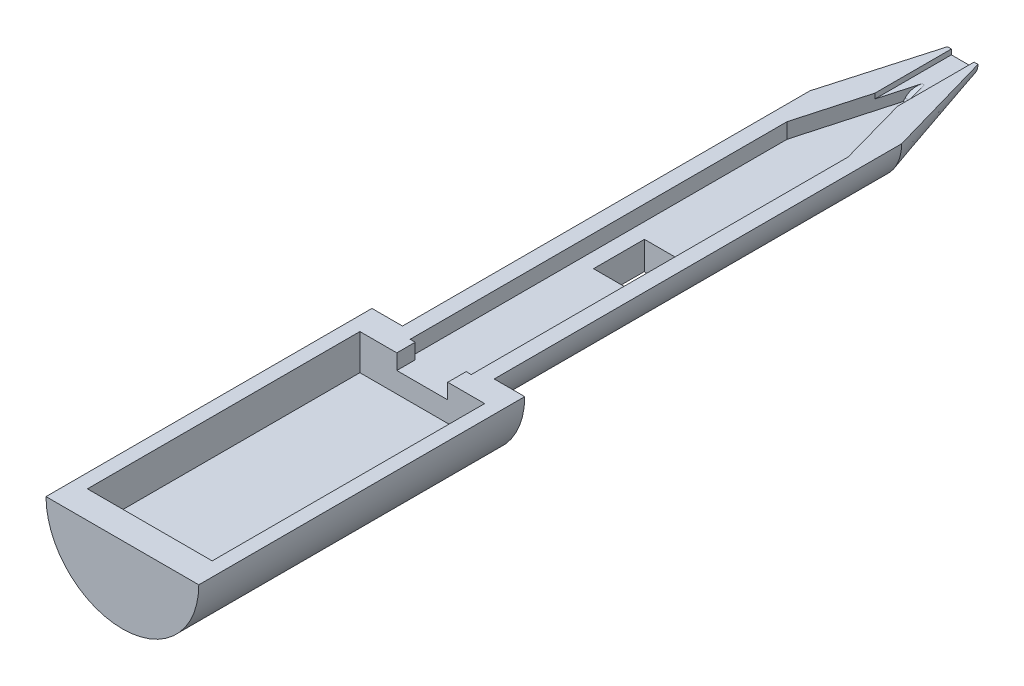
ISO-10303-21;
HEADER;
FILE_DESCRIPTION(('STEP AP214'),'2;1');
FILE_NAME('part.step','',(''),(''),'','','');
FILE_SCHEMA(('AUTOMOTIVE_DESIGN { 1 0 10303 214 1 1 1 1 }'));
ENDSEC;
DATA;
#1=APPLICATION_CONTEXT('core data for automotive mechanical design processes');
#2=APPLICATION_PROTOCOL_DEFINITION('international standard','automotive_design',2000,#1);
#3=PRODUCT_CONTEXT('',#1,'mechanical');
#4=PRODUCT('Part','Part','',(#3));
#5=PRODUCT_RELATED_PRODUCT_CATEGORY('part','',(#4));
#6=PRODUCT_DEFINITION_FORMATION('','',#4);
#7=PRODUCT_DEFINITION_CONTEXT('part definition',#1,'design');
#8=PRODUCT_DEFINITION('design','',#6,#7);
#9=PRODUCT_DEFINITION_SHAPE('','',#8);
#10=(LENGTH_UNIT() NAMED_UNIT(*) SI_UNIT(.MILLI.,.METRE.));
#11=(NAMED_UNIT(*) PLANE_ANGLE_UNIT() SI_UNIT($,.RADIAN.));
#12=(NAMED_UNIT(*) SI_UNIT($,.STERADIAN.) SOLID_ANGLE_UNIT());
#13=UNCERTAINTY_MEASURE_WITH_UNIT(LENGTH_MEASURE(1.E-05),#10,'distance_accuracy_value','');
#14=(GEOMETRIC_REPRESENTATION_CONTEXT(3) GLOBAL_UNCERTAINTY_ASSIGNED_CONTEXT((#13)) GLOBAL_UNIT_ASSIGNED_CONTEXT((#10,
#11,#12)) REPRESENTATION_CONTEXT('',''));
#15=CARTESIAN_POINT('',(0.,0.,0.));
#16=DIRECTION('',(0.,0.,1.));
#17=DIRECTION('',(1.,0.,0.));
#18=AXIS2_PLACEMENT_3D('',#15,#16,#17);
#19=CARTESIAN_POINT('',(12.2500000000001,-6.99999999999991,-58.8824675416096));
#20=DIRECTION('',(0.,0.,-1.));
#21=DIRECTION('',(0.,1.,0.));
#22=AXIS2_PLACEMENT_3D('',#19,#20,#21);
#23=PLANE('',#22);
#24=DIRECTION('',(0.,1.,0.));
#25=VECTOR('',#24,1.);
#26=CARTESIAN_POINT('',(5.00000000000005,-7.39733340645304,-58.8824675416096));
#27=LINE('',#26,#25);
#28=CARTESIAN_POINT('',(5.00000000000005,-2.99999999999997,-58.8824675416096));
#29=VERTEX_POINT('',#28);
#30=CARTESIAN_POINT('',(5.,0.,-58.8824675416096));
#31=VERTEX_POINT('',#30);
#32=EDGE_CURVE('E336',#29,#31,#27,.T.);
#33=ORIENTED_EDGE('',*,*,#32,.F.);
#34=DIRECTION('',(-1.,0.,0.));
#35=VECTOR('',#34,1.);
#36=CARTESIAN_POINT('',(-4.99999999999998,-3.00000000000003,-58.8824675416096));
#37=LINE('',#36,#35);
#38=CARTESIAN_POINT('',(-4.99999999999998,-3.00000000000003,-58.8824675416096));
#39=VERTEX_POINT('',#38);
#40=EDGE_CURVE('E317',#29,#39,#37,.T.);
#41=ORIENTED_EDGE('',*,*,#40,.T.);
#42=DIRECTION('',(0.,1.,0.));
#43=VECTOR('',#42,1.);
#44=CARTESIAN_POINT('',(-4.99999999999995,-7.3973334064531,-58.8824675416096));
#45=LINE('',#44,#43);
#46=CARTESIAN_POINT('',(-5.,0.,-58.8824675416096));
#47=VERTEX_POINT('',#46);
#48=EDGE_CURVE('E322',#39,#47,#45,.T.);
#49=ORIENTED_EDGE('',*,*,#48,.T.);
#50=DIRECTION('',(-1.,0.,0.));
#51=VECTOR('',#50,1.);
#52=CARTESIAN_POINT('',(12.25,0.,-58.8824675416096));
#53=LINE('',#52,#51);
#54=CARTESIAN_POINT('',(-12.25,0.,-58.8824675416096));
#55=VERTEX_POINT('',#54);
#56=EDGE_CURVE('E429',#47,#55,#53,.T.);
#57=ORIENTED_EDGE('',*,*,#56,.T.);
#58=DIRECTION('',(0.,1.,0.));
#59=VECTOR('',#58,1.);
#60=CARTESIAN_POINT('',(-12.25,-7.00000000000009,-58.8824675416096));
#61=LINE('',#60,#59);
#62=CARTESIAN_POINT('',(-12.25,-7.00000000000009,-58.8824675416096));
#63=VERTEX_POINT('',#62);
#64=EDGE_CURVE('E433',#63,#55,#61,.T.);
#65=ORIENTED_EDGE('',*,*,#64,.F.);
#66=DIRECTION('',(-1.,0.,0.));
#67=VECTOR('',#66,1.);
#68=CARTESIAN_POINT('',(12.2500000000001,-6.99999999999991,-58.8824675416096));
#69=LINE('',#68,#67);
#70=CARTESIAN_POINT('',(12.2500000000001,-6.99999999999991,-58.8824675416096));
#71=VERTEX_POINT('',#70);
#72=EDGE_CURVE('E414',#71,#63,#69,.T.);
#73=ORIENTED_EDGE('',*,*,#72,.F.);
#74=DIRECTION('',(0.,1.,0.));
#75=VECTOR('',#74,1.);
#76=CARTESIAN_POINT('',(12.2500000000001,-6.99999999999991,-58.8824675416096));
#77=LINE('',#76,#75);
#78=CARTESIAN_POINT('',(12.25,0.,-58.8824675416096));
#79=VERTEX_POINT('',#78);
#80=EDGE_CURVE('E438',#71,#79,#77,.T.);
#81=ORIENTED_EDGE('',*,*,#80,.T.);
#82=EDGE_CURVE('E406',#79,#31,#53,.T.);
#83=ORIENTED_EDGE('',*,*,#82,.T.);
#84=EDGE_LOOP('',(#33,#41,#49,#57,#65,#73,#81,#83));
#85=FACE_BOUND('',#84,.T.);
#86=ADVANCED_FACE('F44',(#85),#23,.F.);
#87=CARTESIAN_POINT('',(-5.99999999999998,-3.00000000000004,-62.5));
#88=DIRECTION('',(0.,0.,1.));
#89=DIRECTION('',(1.,0.,0.));
#90=AXIS2_PLACEMENT_3D('',#87,#88,#89);
#91=PLANE('',#90);
#92=DIRECTION('',(1.,0.,0.));
#93=VECTOR('',#92,1.);
#94=CARTESIAN_POINT('',(-5.99999999999998,-3.00000000000004,-62.5));
#95=LINE('',#94,#93);
#96=CARTESIAN_POINT('',(5.00000000000002,-2.99999999999997,-62.5));
#97=VERTEX_POINT('',#96);
#98=CARTESIAN_POINT('',(6.00000000000002,-2.99999999999996,-62.5));
#99=VERTEX_POINT('',#98);
#100=EDGE_CURVE('E352',#97,#99,#95,.T.);
#101=ORIENTED_EDGE('',*,*,#100,.F.);
#102=DIRECTION('',(0.,1.,0.));
#103=VECTOR('',#102,1.);
#104=CARTESIAN_POINT('',(5.00000000000005,-7.39733340645304,-62.5));
#105=LINE('',#104,#103);
#106=CARTESIAN_POINT('',(5.,0.,-62.5));
#107=VERTEX_POINT('',#106);
#108=EDGE_CURVE('E339',#97,#107,#105,.T.);
#109=ORIENTED_EDGE('',*,*,#108,.T.);
#110=DIRECTION('',(1.,0.,0.));
#111=VECTOR('',#110,1.);
#112=CARTESIAN_POINT('',(-6.,0.,-62.5));
#113=LINE('',#112,#111);
#114=CARTESIAN_POINT('',(6.,0.,-62.5));
#115=VERTEX_POINT('',#114);
#116=EDGE_CURVE('E373',#107,#115,#113,.T.);
#117=ORIENTED_EDGE('',*,*,#116,.T.);
#118=DIRECTION('',(0.,1.,0.));
#119=VECTOR('',#118,1.);
#120=CARTESIAN_POINT('',(6.00000000000002,-2.99999999999996,-62.5));
#121=LINE('',#120,#119);
#122=EDGE_CURVE('E394',#99,#115,#121,.T.);
#123=ORIENTED_EDGE('',*,*,#122,.F.);
#124=EDGE_LOOP('',(#101,#109,#117,#123));
#125=FACE_BOUND('',#124,.T.);
#126=ADVANCED_FACE('F554',(#125),#91,.F.);
#127=CARTESIAN_POINT('',(0.,0.,0.));
#128=DIRECTION('',(0.,0.,1.));
#129=DIRECTION('',(1.,0.,0.));
#130=AXIS2_PLACEMENT_3D('',#127,#128,#129);
#131=PLANE('',#130);
#132=CARTESIAN_POINT('',(0.,0.,0.));
#133=DIRECTION('',(0.,0.,-1.));
#134=DIRECTION('',(-1.,0.,0.));
#135=AXIS2_PLACEMENT_3D('',#132,#133,#134);
#136=CIRCLE('',#135,15.);
#137=CARTESIAN_POINT('',(15.,1.04744440165294E-13,0.));
#138=VERTEX_POINT('',#137);
#139=CARTESIAN_POINT('',(-15.,0.,0.));
#140=VERTEX_POINT('',#139);
#141=EDGE_CURVE('E240',#138,#140,#136,.T.);
#142=ORIENTED_EDGE('',*,*,#141,.F.);
#143=DIRECTION('',(-1.,0.,0.));
#144=VECTOR('',#143,1.);
#145=CARTESIAN_POINT('',(0.,0.,0.));
#146=LINE('',#145,#144);
#147=EDGE_CURVE('E483',#138,#140,#146,.T.);
#148=ORIENTED_EDGE('',*,*,#147,.T.);
#149=EDGE_LOOP('',(#142,#148));
#150=FACE_BOUND('',#149,.T.);
#151=ADVANCED_FACE('F560',(#150),#131,.T.);
#152=CARTESIAN_POINT('',(0.,0.,-165.));
#153=DIRECTION('',(0.,0.,-1.));
#154=DIRECTION('',(-1.,0.,0.));
#155=AXIS2_PLACEMENT_3D('',#152,#153,#154);
#156=CYLINDRICAL_SURFACE('',#155,15.);
#157=CARTESIAN_POINT('',(0.,0.,-64.));
#158=DIRECTION('',(0.,0.,-1.));
#159=DIRECTION('',(-1.,0.,0.));
#160=AXIS2_PLACEMENT_3D('',#157,#158,#159);
#161=CIRCLE('',#160,15.);
#162=CARTESIAN_POINT('',(15.,1.04744440165294E-13,-64.));
#163=VERTEX_POINT('',#162);
#164=CARTESIAN_POINT('',(-15.,0.,-64.));
#165=VERTEX_POINT('',#164);
#166=EDGE_CURVE('E496',#163,#165,#161,.T.);
#167=ORIENTED_EDGE('',*,*,#166,.F.);
#168=DIRECTION('',(0.,0.,1.));
#169=VECTOR('',#168,1.);
#170=CARTESIAN_POINT('',(15.,1.04744440165294E-13,0.));
#171=LINE('',#170,#169);
#172=EDGE_CURVE('E479',#163,#138,#171,.T.);
#173=ORIENTED_EDGE('',*,*,#172,.T.);
#174=ORIENTED_EDGE('',*,*,#141,.T.);
#175=DIRECTION('',(0.,0.,1.));
#176=VECTOR('',#175,1.);
#177=CARTESIAN_POINT('',(-15.,0.,0.));
#178=LINE('',#177,#176);
#179=EDGE_CURVE('E458',#165,#140,#178,.T.);
#180=ORIENTED_EDGE('',*,*,#179,.F.);
#181=EDGE_LOOP('',(#167,#173,#174,#180));
#182=FACE_BOUND('',#181,.T.);
#183=ADVANCED_FACE('F596',(#182),#156,.T.);
#184=CARTESIAN_POINT('',(15.,1.04744440165294E-13,-64.));
#185=DIRECTION('',(0.,0.,-1.));
#186=DIRECTION('',(-1.,0.,0.));
#187=AXIS2_PLACEMENT_3D('',#184,#185,#186);
#188=PLANE('',#187);
#189=CARTESIAN_POINT('',(0.,0.,-64.));
#190=DIRECTION('',(0.,0.,-1.));
#191=DIRECTION('',(-1.,0.,0.));
#192=AXIS2_PLACEMENT_3D('',#189,#190,#191);
#193=CIRCLE('',#192,8.99999999999999);
#194=CARTESIAN_POINT('',(8.99999999999999,0.,-64.));
#195=VERTEX_POINT('',#194);
#196=CARTESIAN_POINT('',(-8.99999999999999,0.,-64.));
#197=VERTEX_POINT('',#196);
#198=EDGE_CURVE('E493',#195,#197,#193,.T.);
#199=ORIENTED_EDGE('',*,*,#198,.F.);
#200=DIRECTION('',(1.,0.,0.));
#201=VECTOR('',#200,1.);
#202=CARTESIAN_POINT('',(15.,1.04744440165294E-13,-64.));
#203=LINE('',#202,#201);
#204=EDGE_CURVE('E475',#195,#163,#203,.T.);
#205=ORIENTED_EDGE('',*,*,#204,.T.);
#206=ORIENTED_EDGE('',*,*,#166,.T.);
#207=DIRECTION('',(-1.,0.,0.));
#208=VECTOR('',#207,1.);
#209=CARTESIAN_POINT('',(-15.,0.,-64.));
#210=LINE('',#209,#208);
#211=EDGE_CURVE('E454',#197,#165,#210,.T.);
#212=ORIENTED_EDGE('',*,*,#211,.F.);
#213=EDGE_LOOP('',(#199,#205,#206,#212));
#214=FACE_BOUND('',#213,.T.);
#215=ADVANCED_FACE('F592',(#214),#188,.T.);
#216=CARTESIAN_POINT('',(0.,0.,-165.));
#217=DIRECTION('',(0.,0.,-1.));
#218=DIRECTION('',(-1.,0.,0.));
#219=AXIS2_PLACEMENT_3D('',#216,#217,#218);
#220=CYLINDRICAL_SURFACE('',#219,8.99999999999999);
#221=DIRECTION('',(0.,0.,-1.));
#222=VECTOR('',#221,1.);
#223=CARTESIAN_POINT('',(-2.99999999999993,-8.48528137423858,-165.));
#224=LINE('',#223,#222);
#225=CARTESIAN_POINT('',(-2.99999999999993,-8.48528137423858,-105.5));
#226=VERTEX_POINT('',#225);
#227=CARTESIAN_POINT('',(-2.99999999999994,-8.48528137423858,-95.5));
#228=VERTEX_POINT('',#227);
#229=EDGE_CURVE('E276',#226,#228,#224,.F.);
#230=ORIENTED_EDGE('',*,*,#229,.T.);
#231=CARTESIAN_POINT('',(0.,0.,-95.5));
#232=DIRECTION('',(0.,0.,1.));
#233=DIRECTION('',(1.,0.,0.));
#234=AXIS2_PLACEMENT_3D('',#231,#232,#233);
#235=CIRCLE('',#234,8.99999999999999);
#236=CARTESIAN_POINT('',(3.00000000000006,-8.48528137423854,-95.5));
#237=VERTEX_POINT('',#236);
#238=EDGE_CURVE('E303',#228,#237,#235,.T.);
#239=ORIENTED_EDGE('',*,*,#238,.T.);
#240=DIRECTION('',(0.,0.,-1.));
#241=VECTOR('',#240,1.);
#242=CARTESIAN_POINT('',(3.00000000000005,-8.48528137423854,-165.));
#243=LINE('',#242,#241);
#244=CARTESIAN_POINT('',(3.00000000000005,-8.48528137423854,-105.5));
#245=VERTEX_POINT('',#244);
#246=EDGE_CURVE('E298',#237,#245,#243,.T.);
#247=ORIENTED_EDGE('',*,*,#246,.T.);
#248=CARTESIAN_POINT('',(0.,0.,-105.5));
#249=DIRECTION('',(0.,0.,-1.));
#250=DIRECTION('',(0.,1.,0.));
#251=AXIS2_PLACEMENT_3D('',#248,#249,#250);
#252=CIRCLE('',#251,8.99999999999999);
#253=EDGE_CURVE('E292',#245,#226,#252,.T.);
#254=ORIENTED_EDGE('',*,*,#253,.T.);
#255=EDGE_LOOP('',(#230,#239,#247,#254));
#256=FACE_BOUND('',#255,.T.);
#257=CARTESIAN_POINT('',(0.,0.,-144.));
#258=DIRECTION('',(0.,0.,-1.));
#259=DIRECTION('',(-1.,0.,0.));
#260=AXIS2_PLACEMENT_3D('',#257,#258,#259);
#261=CIRCLE('',#260,8.99999999999999);
#262=CARTESIAN_POINT('',(8.99999999999999,0.,-144.));
#263=VERTEX_POINT('',#262);
#264=CARTESIAN_POINT('',(-8.99999999999999,0.,-144.));
#265=VERTEX_POINT('',#264);
#266=EDGE_CURVE('E490',#263,#265,#261,.T.);
#267=ORIENTED_EDGE('',*,*,#266,.F.);
#268=DIRECTION('',(0.,0.,1.));
#269=VECTOR('',#268,1.);
#270=CARTESIAN_POINT('',(8.99999999999999,0.,-64.));
#271=LINE('',#270,#269);
#272=EDGE_CURVE('E471',#263,#195,#271,.T.);
#273=ORIENTED_EDGE('',*,*,#272,.T.);
#274=ORIENTED_EDGE('',*,*,#198,.T.);
#275=DIRECTION('',(0.,0.,1.));
#276=VECTOR('',#275,1.);
#277=CARTESIAN_POINT('',(-8.99999999999999,0.,-64.));
#278=LINE('',#277,#276);
#279=EDGE_CURVE('E450',#265,#197,#278,.T.);
#280=ORIENTED_EDGE('',*,*,#279,.F.);
#281=EDGE_LOOP('',(#267,#273,#274,#280));
#282=FACE_BOUND('',#281,.T.);
#283=ADVANCED_FACE('F588',(#256,#282),#220,.T.);
#284=CARTESIAN_POINT('',(0.,0.,-165.));
#285=DIRECTION('',(0.,0.,1.));
#286=DIRECTION('',(1.,0.,0.));
#287=AXIS2_PLACEMENT_3D('',#284,#285,#286);
#288=CONICAL_SURFACE('',#287,3.,0.278299659005111);
#289=CARTESIAN_POINT('',(0.,0.,-165.));
#290=DIRECTION('',(0.,0.,-1.));
#291=DIRECTION('',(-1.,0.,0.));
#292=AXIS2_PLACEMENT_3D('',#289,#290,#291);
#293=CIRCLE('',#292,3.);
#294=CARTESIAN_POINT('',(3.,0.,-165.));
#295=VERTEX_POINT('',#294);
#296=CARTESIAN_POINT('',(-3.,0.,-165.));
#297=VERTEX_POINT('',#296);
#298=EDGE_CURVE('E486',#295,#297,#293,.T.);
#299=ORIENTED_EDGE('',*,*,#298,.F.);
#300=DIRECTION('',(0.274721127897378,0.,0.961523947640823));
#301=VECTOR('',#300,1.);
#302=CARTESIAN_POINT('',(8.99999999999999,0.,-144.));
#303=LINE('',#302,#301);
#304=EDGE_CURVE('E467',#295,#263,#303,.T.);
#305=ORIENTED_EDGE('',*,*,#304,.T.);
#306=ORIENTED_EDGE('',*,*,#266,.T.);
#307=DIRECTION('',(-0.274721127897378,0.,0.961523947640823));
#308=VECTOR('',#307,1.);
#309=CARTESIAN_POINT('',(-8.99999999999999,0.,-144.));
#310=LINE('',#309,#308);
#311=EDGE_CURVE('E437',#297,#265,#310,.T.);
#312=ORIENTED_EDGE('',*,*,#311,.F.);
#313=EDGE_LOOP('',(#299,#305,#306,#312));
#314=FACE_BOUND('',#313,.T.);
#315=ADVANCED_FACE('F585',(#314),#288,.T.);
#316=CARTESIAN_POINT('',(3.,0.,-165.));
#317=DIRECTION('',(0.,0.,-1.));
#318=DIRECTION('',(-1.,0.,0.));
#319=AXIS2_PLACEMENT_3D('',#316,#317,#318);
#320=PLANE('',#319);
#321=DIRECTION('',(0.,1.,0.));
#322=VECTOR('',#321,1.);
#323=CARTESIAN_POINT('',(-2.22794117647058,-1.00000000000002,-165.));
#324=LINE('',#323,#322);
#325=CARTESIAN_POINT('',(-2.22794117647058,-1.00000000000002,-165.));
#326=VERTEX_POINT('',#325);
#327=CARTESIAN_POINT('',(-2.22794117647059,0.,-165.));
#328=VERTEX_POINT('',#327);
#329=EDGE_CURVE('E261',#326,#328,#324,.T.);
#330=ORIENTED_EDGE('',*,*,#329,.F.);
#331=DIRECTION('',(-1.,0.,0.));
#332=VECTOR('',#331,1.);
#333=CARTESIAN_POINT('',(-2.22794117647058,-1.00000000000002,-165.));
#334=LINE('',#333,#332);
#335=CARTESIAN_POINT('',(2.2279411764706,-0.999999999999984,-165.));
#336=VERTEX_POINT('',#335);
#337=EDGE_CURVE('E249',#336,#326,#334,.T.);
#338=ORIENTED_EDGE('',*,*,#337,.F.);
#339=DIRECTION('',(0.,1.,0.));
#340=VECTOR('',#339,1.);
#341=CARTESIAN_POINT('',(2.2279411764706,-0.999999999999984,-165.));
#342=LINE('',#341,#340);
#343=CARTESIAN_POINT('',(2.22794117647059,0.,-165.));
#344=VERTEX_POINT('',#343);
#345=EDGE_CURVE('E247',#336,#344,#342,.T.);
#346=ORIENTED_EDGE('',*,*,#345,.T.);
#347=DIRECTION('',(1.,0.,0.));
#348=VECTOR('',#347,1.);
#349=CARTESIAN_POINT('',(3.,0.,-165.));
#350=LINE('',#349,#348);
#351=EDGE_CURVE('E462',#344,#295,#350,.T.);
#352=ORIENTED_EDGE('',*,*,#351,.T.);
#353=ORIENTED_EDGE('',*,*,#298,.T.);
#354=EDGE_CURVE('E463',#297,#328,#350,.T.);
#355=ORIENTED_EDGE('',*,*,#354,.T.);
#356=EDGE_LOOP('',(#330,#338,#346,#352,#353,#355));
#357=FACE_BOUND('',#356,.T.);
#358=ADVANCED_FACE('F536',(#357),#320,.T.);
#359=CARTESIAN_POINT('',(0.,0.,0.));
#360=DIRECTION('',(0.,1.,0.));
#361=DIRECTION('',(0.,0.,-1.));
#362=AXIS2_PLACEMENT_3D('',#359,#360,#361);
#363=PLANE('',#362);
#364=DIRECTION('',(0.,0.,1.));
#365=VECTOR('',#364,1.);
#366=CARTESIAN_POINT('',(-2.22794117647059,0.,-150.));
#367=LINE('',#366,#365);
#368=CARTESIAN_POINT('',(-2.22794117647059,0.,-150.));
#369=VERTEX_POINT('',#368);
#370=EDGE_CURVE('E250',#328,#369,#367,.T.);
#371=ORIENTED_EDGE('',*,*,#370,.F.);
#372=ORIENTED_EDGE('',*,*,#354,.F.);
#373=ORIENTED_EDGE('',*,*,#311,.T.);
#374=ORIENTED_EDGE('',*,*,#279,.T.);
#375=ORIENTED_EDGE('',*,*,#211,.T.);
#376=ORIENTED_EDGE('',*,*,#179,.T.);
#377=ORIENTED_EDGE('',*,*,#147,.F.);
#378=ORIENTED_EDGE('',*,*,#172,.F.);
#379=ORIENTED_EDGE('',*,*,#204,.F.);
#380=ORIENTED_EDGE('',*,*,#272,.F.);
#381=ORIENTED_EDGE('',*,*,#304,.F.);
#382=ORIENTED_EDGE('',*,*,#351,.F.);
#383=DIRECTION('',(0.,0.,-1.));
#384=VECTOR('',#383,1.);
#385=CARTESIAN_POINT('',(2.22794117647059,0.,-165.));
#386=LINE('',#385,#384);
#387=CARTESIAN_POINT('',(2.22794117647059,0.,-150.));
#388=VERTEX_POINT('',#387);
#389=EDGE_CURVE('E530',#388,#344,#386,.T.);
#390=ORIENTED_EDGE('',*,*,#389,.F.);
#391=DIRECTION('',(-0.26910453685374,0.,-0.963110974002858));
#392=VECTOR('',#391,1.);
#393=CARTESIAN_POINT('',(6.00000000000001,0.,-136.5));
#394=LINE('',#393,#392);
#395=CARTESIAN_POINT('',(6.00000000000001,0.,-136.5));
#396=VERTEX_POINT('',#395);
#397=EDGE_CURVE('E255',#396,#388,#394,.T.);
#398=ORIENTED_EDGE('',*,*,#397,.F.);
#399=DIRECTION('',(0.,0.,-1.));
#400=VECTOR('',#399,1.);
#401=CARTESIAN_POINT('',(6.,0.,-62.5));
#402=LINE('',#401,#400);
#403=EDGE_CURVE('E378',#115,#396,#402,.T.);
#404=ORIENTED_EDGE('',*,*,#403,.F.);
#405=ORIENTED_EDGE('',*,*,#116,.F.);
#406=DIRECTION('',(0.,0.,-1.));
#407=VECTOR('',#406,1.);
#408=CARTESIAN_POINT('',(5.,0.,-58.8824675416096));
#409=LINE('',#408,#407);
#410=EDGE_CURVE('E327',#31,#107,#409,.T.);
#411=ORIENTED_EDGE('',*,*,#410,.F.);
#412=ORIENTED_EDGE('',*,*,#82,.F.);
#413=DIRECTION('',(0.,0.,-1.));
#414=VECTOR('',#413,1.);
#415=CARTESIAN_POINT('',(12.25,0.,-5.38246754160956));
#416=LINE('',#415,#414);
#417=CARTESIAN_POINT('',(12.25,0.,-5.38246754160956));
#418=VERTEX_POINT('',#417);
#419=EDGE_CURVE('E425',#418,#79,#416,.T.);
#420=ORIENTED_EDGE('',*,*,#419,.F.);
#421=DIRECTION('',(1.,0.,0.));
#422=VECTOR('',#421,1.);
#423=CARTESIAN_POINT('',(-12.25,0.,-5.38246754160956));
#424=LINE('',#423,#422);
#425=CARTESIAN_POINT('',(-12.25,0.,-5.38246754160956));
#426=VERTEX_POINT('',#425);
#427=EDGE_CURVE('E421',#426,#418,#424,.T.);
#428=ORIENTED_EDGE('',*,*,#427,.F.);
#429=DIRECTION('',(0.,0.,1.));
#430=VECTOR('',#429,1.);
#431=CARTESIAN_POINT('',(-12.25,0.,-58.8824675416096));
#432=LINE('',#431,#430);
#433=EDGE_CURVE('E390',#55,#426,#432,.T.);
#434=ORIENTED_EDGE('',*,*,#433,.F.);
#435=ORIENTED_EDGE('',*,*,#56,.F.);
#436=DIRECTION('',(0.,0.,1.));
#437=VECTOR('',#436,1.);
#438=CARTESIAN_POINT('',(-5.,0.,-62.5));
#439=LINE('',#438,#437);
#440=CARTESIAN_POINT('',(-5.,0.,-62.5));
#441=VERTEX_POINT('',#440);
#442=EDGE_CURVE('E323',#441,#47,#439,.T.);
#443=ORIENTED_EDGE('',*,*,#442,.F.);
#444=CARTESIAN_POINT('',(-6.,0.,-62.5));
#445=VERTEX_POINT('',#444);
#446=EDGE_CURVE('E374',#445,#441,#113,.T.);
#447=ORIENTED_EDGE('',*,*,#446,.F.);
#448=DIRECTION('',(0.,0.,1.));
#449=VECTOR('',#448,1.);
#450=CARTESIAN_POINT('',(-6.00000000000001,0.,-136.5));
#451=LINE('',#450,#449);
#452=CARTESIAN_POINT('',(-6.00000000000001,0.,-136.5));
#453=VERTEX_POINT('',#452);
#454=EDGE_CURVE('E335',#453,#445,#451,.T.);
#455=ORIENTED_EDGE('',*,*,#454,.F.);
#456=DIRECTION('',(-0.26910453685374,0.,0.963110974002858));
#457=VECTOR('',#456,1.);
#458=CARTESIAN_POINT('',(-1.25,0.,-153.5));
#459=LINE('',#458,#457);
#460=EDGE_CURVE('E353',#369,#453,#459,.T.);
#461=ORIENTED_EDGE('',*,*,#460,.F.);
#462=EDGE_LOOP('',(#371,#372,#373,#374,#375,#376,#377,#378,#379,#380,#381,#382,#390,#398,#404,
#405,#411,#412,#420,#428,#434,#435,#443,#447,#455,#461));
#463=FACE_BOUND('',#462,.T.);
#464=ADVANCED_FACE('F540',(#463),#363,.T.);
#465=CARTESIAN_POINT('',(-12.25,-7.00000000000009,-58.8824675416096));
#466=DIRECTION('',(-1.,0.,0.));
#467=DIRECTION('',(0.,-1.,0.));
#468=AXIS2_PLACEMENT_3D('',#465,#466,#467);
#469=PLANE('',#468);
#470=ORIENTED_EDGE('',*,*,#433,.T.);
#471=DIRECTION('',(0.,1.,0.));
#472=VECTOR('',#471,1.);
#473=CARTESIAN_POINT('',(-12.25,-7.00000000000009,-5.38246754160956));
#474=LINE('',#473,#472);
#475=CARTESIAN_POINT('',(-12.25,-7.00000000000009,-5.38246754160956));
#476=VERTEX_POINT('',#475);
#477=EDGE_CURVE('E418',#476,#426,#474,.T.);
#478=ORIENTED_EDGE('',*,*,#477,.F.);
#479=DIRECTION('',(0.,0.,1.));
#480=VECTOR('',#479,1.);
#481=CARTESIAN_POINT('',(-12.25,-7.00000000000009,-58.8824675416096));
#482=LINE('',#481,#480);
#483=EDGE_CURVE('E401',#63,#476,#482,.T.);
#484=ORIENTED_EDGE('',*,*,#483,.F.);
#485=ORIENTED_EDGE('',*,*,#64,.T.);
#486=EDGE_LOOP('',(#470,#478,#484,#485));
#487=FACE_BOUND('',#486,.T.);
#488=ADVANCED_FACE('F573',(#487),#469,.F.);
#489=CARTESIAN_POINT('',(12.25,-6.99999999999991,-5.38246754160956));
#490=DIRECTION('',(1.,0.,0.));
#491=DIRECTION('',(0.,1.,0.));
#492=AXIS2_PLACEMENT_3D('',#489,#490,#491);
#493=PLANE('',#492);
#494=ORIENTED_EDGE('',*,*,#419,.T.);
#495=ORIENTED_EDGE('',*,*,#80,.F.);
#496=DIRECTION('',(0.,0.,-1.));
#497=VECTOR('',#496,1.);
#498=CARTESIAN_POINT('',(12.25,-6.99999999999991,-5.38246754160956));
#499=LINE('',#498,#497);
#500=CARTESIAN_POINT('',(12.25,-6.99999999999991,-5.38246754160956));
#501=VERTEX_POINT('',#500);
#502=EDGE_CURVE('E410',#501,#71,#499,.T.);
#503=ORIENTED_EDGE('',*,*,#502,.F.);
#504=DIRECTION('',(0.,1.,0.));
#505=VECTOR('',#504,1.);
#506=CARTESIAN_POINT('',(12.25,-6.99999999999991,-5.38246754160956));
#507=LINE('',#506,#505);
#508=EDGE_CURVE('E441',#501,#418,#507,.T.);
#509=ORIENTED_EDGE('',*,*,#508,.T.);
#510=EDGE_LOOP('',(#494,#495,#503,#509));
#511=FACE_BOUND('',#510,.T.);
#512=ADVANCED_FACE('F569',(#511),#493,.F.);
#513=CARTESIAN_POINT('',(-12.25,-7.00000000000009,-5.38246754160956));
#514=DIRECTION('',(0.,0.,1.));
#515=DIRECTION('',(0.,-1.,0.));
#516=AXIS2_PLACEMENT_3D('',#513,#514,#515);
#517=PLANE('',#516);
#518=ORIENTED_EDGE('',*,*,#427,.T.);
#519=ORIENTED_EDGE('',*,*,#508,.F.);
#520=DIRECTION('',(1.,0.,0.));
#521=VECTOR('',#520,1.);
#522=CARTESIAN_POINT('',(-12.25,-7.00000000000009,-5.38246754160956));
#523=LINE('',#522,#521);
#524=EDGE_CURVE('E405',#476,#501,#523,.T.);
#525=ORIENTED_EDGE('',*,*,#524,.F.);
#526=ORIENTED_EDGE('',*,*,#477,.T.);
#527=EDGE_LOOP('',(#518,#519,#525,#526));
#528=FACE_BOUND('',#527,.T.);
#529=ADVANCED_FACE('F572',(#528),#517,.F.);
#530=CARTESIAN_POINT('',(0.,-7.,0.));
#531=DIRECTION('',(0.,1.,0.));
#532=DIRECTION('',(-1.,0.,0.));
#533=AXIS2_PLACEMENT_3D('',#530,#531,#532);
#534=PLANE('',#533);
#535=ORIENTED_EDGE('',*,*,#483,.T.);
#536=ORIENTED_EDGE('',*,*,#524,.T.);
#537=ORIENTED_EDGE('',*,*,#502,.T.);
#538=ORIENTED_EDGE('',*,*,#72,.T.);
#539=EDGE_LOOP('',(#535,#536,#537,#538));
#540=FACE_BOUND('',#539,.T.);
#541=ADVANCED_FACE('F567',(#540),#534,.T.);
#542=CARTESIAN_POINT('',(-5.99999999999999,-3.00000000000004,-136.5));
#543=DIRECTION('',(-1.,0.,0.));
#544=DIRECTION('',(0.,-1.,0.));
#545=AXIS2_PLACEMENT_3D('',#542,#543,#544);
#546=PLANE('',#545);
#547=ORIENTED_EDGE('',*,*,#454,.T.);
#548=DIRECTION('',(0.,1.,0.));
#549=VECTOR('',#548,1.);
#550=CARTESIAN_POINT('',(-5.99999999999998,-3.00000000000004,-62.5));
#551=LINE('',#550,#549);
#552=CARTESIAN_POINT('',(-5.99999999999998,-3.00000000000004,-62.5));
#553=VERTEX_POINT('',#552);
#554=EDGE_CURVE('E370',#553,#445,#551,.T.);
#555=ORIENTED_EDGE('',*,*,#554,.F.);
#556=DIRECTION('',(0.,0.,1.));
#557=VECTOR('',#556,1.);
#558=CARTESIAN_POINT('',(-5.99999999999999,-3.00000000000004,-136.5));
#559=LINE('',#558,#557);
#560=CARTESIAN_POINT('',(-5.99999999999999,-3.00000000000004,-136.5));
#561=VERTEX_POINT('',#560);
#562=EDGE_CURVE('E348',#561,#553,#559,.T.);
#563=ORIENTED_EDGE('',*,*,#562,.F.);
#564=DIRECTION('',(0.,1.,0.));
#565=VECTOR('',#564,1.);
#566=CARTESIAN_POINT('',(-5.99999999999999,-3.00000000000004,-136.5));
#567=LINE('',#566,#565);
#568=EDGE_CURVE('E386',#561,#453,#567,.T.);
#569=ORIENTED_EDGE('',*,*,#568,.T.);
#570=EDGE_LOOP('',(#547,#555,#563,#569));
#571=FACE_BOUND('',#570,.T.);
#572=ADVANCED_FACE('F645',(#571),#546,.F.);
#573=CARTESIAN_POINT('',(-1.24999999999998,-3.00000000000001,-153.5));
#574=DIRECTION('',(-0.963110974002858,0.,-0.26910453685374));
#575=DIRECTION('',(-0.26910453685374,0.,0.963110974002858));
#576=AXIS2_PLACEMENT_3D('',#573,#574,#575);
#577=PLANE('',#576);
#578=DIRECTION('',(-0.26910453685374,0.,0.963110974002858));
#579=VECTOR('',#578,1.);
#580=CARTESIAN_POINT('',(-1.24999999999999,-1.00000000000001,-153.5));
#581=LINE('',#580,#579);
#582=CARTESIAN_POINT('',(-0.207221097885146,-1.,-157.232050807569));
#583=VERTEX_POINT('',#582);
#584=CARTESIAN_POINT('',(-2.22794117647058,-1.00000000000002,-150.));
#585=VERTEX_POINT('',#584);
#586=EDGE_CURVE('E267',#583,#585,#581,.T.);
#587=ORIENTED_EDGE('',*,*,#586,.T.);
#588=DIRECTION('',(0.,1.,0.));
#589=VECTOR('',#588,1.);
#590=CARTESIAN_POINT('',(-2.22794117647058,-1.00000000000002,-150.));
#591=LINE('',#590,#589);
#592=EDGE_CURVE('E272',#585,#369,#591,.T.);
#593=ORIENTED_EDGE('',*,*,#592,.T.);
#594=ORIENTED_EDGE('',*,*,#460,.T.);
#595=ORIENTED_EDGE('',*,*,#568,.F.);
#596=DIRECTION('',(-0.26910453685374,0.,0.963110974002858));
#597=VECTOR('',#596,1.);
#598=CARTESIAN_POINT('',(-1.24999999999998,-3.00000000000001,-153.5));
#599=LINE('',#598,#597);
#600=CARTESIAN_POINT('',(-1.01381338572358,-3.00000000000001,-154.345299461621));
#601=VERTEX_POINT('',#600);
#602=EDGE_CURVE('E366',#601,#561,#599,.T.);
#603=ORIENTED_EDGE('',*,*,#602,.F.);
#604=DIRECTION('',(-0.138362149538377,-0.857695713339727,0.495190850979475));
#605=VECTOR('',#604,1.);
#606=CARTESIAN_POINT('',(-1.07625122165548,-3.38704706747956,-154.121837733022));
#607=LINE('',#606,#605);
#608=CARTESIAN_POINT('',(-0.933154156939743,-2.50000000000002,-154.633974596216));
#609=VERTEX_POINT('',#608);
#610=EDGE_CURVE('E505',#601,#609,#607,.F.);
#611=ORIENTED_EDGE('',*,*,#610,.T.);
#612=CARTESIAN_POINT('',(-0.207221097885125,-4.,-157.232050807569));
#613=DIRECTION('',(-0.963110974002858,0.,-0.26910453685374));
#614=DIRECTION('',(0.26910453685374,0.,-0.963110974002858));
#615=AXIS2_PLACEMENT_3D('',#612,#613,#614);
#616=ELLIPSE('',#615,3.11490584260656,3.);
#617=EDGE_CURVE('E11',#609,#583,#616,.T.);
#618=ORIENTED_EDGE('',*,*,#617,.T.);
#619=EDGE_LOOP('',(#587,#593,#594,#595,#603,#611,#618));
#620=FACE_BOUND('',#619,.T.);
#621=ADVANCED_FACE('F545',(#620),#577,.F.);
#622=CARTESIAN_POINT('',(6.00000000000003,-2.99999999999996,-136.5));
#623=DIRECTION('',(0.963110974002858,0.,-0.26910453685374));
#624=DIRECTION('',(-0.26910453685374,0.,-0.963110974002858));
#625=AXIS2_PLACEMENT_3D('',#622,#623,#624);
#626=PLANE('',#625);
#627=ORIENTED_EDGE('',*,*,#397,.T.);
#628=DIRECTION('',(0.,1.,0.));
#629=VECTOR('',#628,1.);
#630=CARTESIAN_POINT('',(2.2279411764706,-0.999999999999984,-150.));
#631=LINE('',#630,#629);
#632=CARTESIAN_POINT('',(2.2279411764706,-0.999999999999984,-150.));
#633=VERTEX_POINT('',#632);
#634=EDGE_CURVE('E244',#633,#388,#631,.T.);
#635=ORIENTED_EDGE('',*,*,#634,.F.);
#636=DIRECTION('',(-0.26910453685374,0.,-0.963110974002858));
#637=VECTOR('',#636,1.);
#638=CARTESIAN_POINT('',(6.00000000000002,-0.999999999999958,-136.5));
#639=LINE('',#638,#637);
#640=CARTESIAN_POINT('',(0.207221097885161,-0.999999999999999,-157.232050807569));
#641=VERTEX_POINT('',#640);
#642=EDGE_CURVE('E230',#633,#641,#639,.T.);
#643=ORIENTED_EDGE('',*,*,#642,.T.);
#644=CARTESIAN_POINT('',(0.207221097885181,-4.,-157.232050807569));
#645=DIRECTION('',(0.963110974002858,0.,-0.26910453685374));
#646=DIRECTION('',(0.26910453685374,0.,0.963110974002858));
#647=AXIS2_PLACEMENT_3D('',#644,#645,#646);
#648=ELLIPSE('',#647,3.11490584260656,3.);
#649=CARTESIAN_POINT('',(0.933154156939779,-2.50000000000001,-154.633974596216));
#650=VERTEX_POINT('',#649);
#651=EDGE_CURVE('E53',#641,#650,#648,.T.);
#652=ORIENTED_EDGE('',*,*,#651,.T.);
#653=DIRECTION('',(-0.138362149538389,0.857695713339725,-0.495190850979475));
#654=VECTOR('',#653,1.);
#655=CARTESIAN_POINT('',(2.33195202241921,-11.1710342174729,-149.627750656605));
#656=LINE('',#655,#654);
#657=CARTESIAN_POINT('',(1.01381338572362,-2.99999999999999,-154.345299461621));
#658=VERTEX_POINT('',#657);
#659=EDGE_CURVE('E508',#650,#658,#656,.F.);
#660=ORIENTED_EDGE('',*,*,#659,.T.);
#661=DIRECTION('',(-0.26910453685374,0.,-0.963110974002858));
#662=VECTOR('',#661,1.);
#663=CARTESIAN_POINT('',(6.00000000000003,-2.99999999999996,-136.5));
#664=LINE('',#663,#662);
#665=CARTESIAN_POINT('',(6.00000000000003,-2.99999999999996,-136.5));
#666=VERTEX_POINT('',#665);
#667=EDGE_CURVE('E362',#666,#658,#664,.T.);
#668=ORIENTED_EDGE('',*,*,#667,.F.);
#669=DIRECTION('',(0.,1.,0.));
#670=VECTOR('',#669,1.);
#671=CARTESIAN_POINT('',(6.00000000000003,-2.99999999999996,-136.5));
#672=LINE('',#671,#670);
#673=EDGE_CURVE('E391',#666,#396,#672,.T.);
#674=ORIENTED_EDGE('',*,*,#673,.T.);
#675=EDGE_LOOP('',(#627,#635,#643,#652,#660,#668,#674));
#676=FACE_BOUND('',#675,.T.);
#677=ADVANCED_FACE('F253',(#676),#626,.F.);
#678=CARTESIAN_POINT('',(6.00000000000002,-2.99999999999996,-62.5));
#679=DIRECTION('',(1.,0.,0.));
#680=DIRECTION('',(0.,1.,0.));
#681=AXIS2_PLACEMENT_3D('',#678,#679,#680);
#682=PLANE('',#681);
#683=ORIENTED_EDGE('',*,*,#403,.T.);
#684=ORIENTED_EDGE('',*,*,#673,.F.);
#685=DIRECTION('',(0.,0.,-1.));
#686=VECTOR('',#685,1.);
#687=CARTESIAN_POINT('',(6.00000000000002,-2.99999999999996,-62.5));
#688=LINE('',#687,#686);
#689=EDGE_CURVE('E358',#99,#666,#688,.T.);
#690=ORIENTED_EDGE('',*,*,#689,.F.);
#691=ORIENTED_EDGE('',*,*,#122,.T.);
#692=EDGE_LOOP('',(#683,#684,#690,#691));
#693=FACE_BOUND('',#692,.T.);
#694=ADVANCED_FACE('F621',(#693),#682,.F.);
#695=ORIENTED_EDGE('',*,*,#446,.T.);
#696=DIRECTION('',(0.,1.,0.));
#697=VECTOR('',#696,1.);
#698=CARTESIAN_POINT('',(-4.99999999999995,-7.3973334064531,-62.5));
#699=LINE('',#698,#697);
#700=CARTESIAN_POINT('',(-4.99999999999998,-3.00000000000003,-62.5));
#701=VERTEX_POINT('',#700);
#702=EDGE_CURVE('E326',#701,#441,#699,.T.);
#703=ORIENTED_EDGE('',*,*,#702,.F.);
#704=EDGE_CURVE('E354',#553,#701,#95,.T.);
#705=ORIENTED_EDGE('',*,*,#704,.F.);
#706=ORIENTED_EDGE('',*,*,#554,.T.);
#707=EDGE_LOOP('',(#695,#703,#705,#706));
#708=FACE_BOUND('',#707,.T.);
#709=ADVANCED_FACE('F563',(#708),#91,.F.);
#710=CARTESIAN_POINT('',(0.,-3.,0.));
#711=DIRECTION('',(0.,1.,0.));
#712=DIRECTION('',(-1.,0.,0.));
#713=AXIS2_PLACEMENT_3D('',#710,#711,#712);
#714=PLANE('',#713);
#715=DIRECTION('',(0.,0.,1.));
#716=VECTOR('',#715,1.);
#717=CARTESIAN_POINT('',(-2.99999999999998,-3.00000000000002,-105.5));
#718=LINE('',#717,#716);
#719=CARTESIAN_POINT('',(-2.99999999999998,-3.00000000000002,-105.5));
#720=VERTEX_POINT('',#719);
#721=CARTESIAN_POINT('',(-2.99999999999998,-3.00000000000002,-95.5));
#722=VERTEX_POINT('',#721);
#723=EDGE_CURVE('E281',#720,#722,#718,.T.);
#724=ORIENTED_EDGE('',*,*,#723,.F.);
#725=DIRECTION('',(-1.,0.,0.));
#726=VECTOR('',#725,1.);
#727=CARTESIAN_POINT('',(3.00000000000002,-2.99999999999998,-105.5));
#728=LINE('',#727,#726);
#729=CARTESIAN_POINT('',(3.00000000000006,-2.99999999999998,-105.5));
#730=VERTEX_POINT('',#729);
#731=EDGE_CURVE('E271',#730,#720,#728,.T.);
#732=ORIENTED_EDGE('',*,*,#731,.F.);
#733=DIRECTION('',(0.,0.,-1.));
#734=VECTOR('',#733,1.);
#735=CARTESIAN_POINT('',(3.00000000000002,-2.99999999999998,-95.5));
#736=LINE('',#735,#734);
#737=CARTESIAN_POINT('',(3.00000000000002,-2.99999999999998,-95.5));
#738=VERTEX_POINT('',#737);
#739=EDGE_CURVE('E273',#738,#730,#736,.T.);
#740=ORIENTED_EDGE('',*,*,#739,.F.);
#741=DIRECTION('',(1.,0.,0.));
#742=VECTOR('',#741,1.);
#743=CARTESIAN_POINT('',(-2.99999999999998,-3.00000000000002,-95.5));
#744=LINE('',#743,#742);
#745=EDGE_CURVE('E277',#722,#738,#744,.T.);
#746=ORIENTED_EDGE('',*,*,#745,.F.);
#747=EDGE_LOOP('',(#724,#732,#740,#746));
#748=FACE_BOUND('',#747,.T.);
#749=ORIENTED_EDGE('',*,*,#562,.T.);
#750=ORIENTED_EDGE('',*,*,#704,.T.);
#751=DIRECTION('',(0.,0.,-1.));
#752=VECTOR('',#751,1.);
#753=CARTESIAN_POINT('',(-4.99999999999998,-3.00000000000003,-62.5));
#754=LINE('',#753,#752);
#755=EDGE_CURVE('E321',#39,#701,#754,.T.);
#756=ORIENTED_EDGE('',*,*,#755,.F.);
#757=ORIENTED_EDGE('',*,*,#40,.F.);
#758=DIRECTION('',(0.,0.,1.));
#759=VECTOR('',#758,1.);
#760=CARTESIAN_POINT('',(5.00000000000002,-2.99999999999997,-58.8824675416096));
#761=LINE('',#760,#759);
#762=EDGE_CURVE('E316',#97,#29,#761,.T.);
#763=ORIENTED_EDGE('',*,*,#762,.F.);
#764=ORIENTED_EDGE('',*,*,#100,.T.);
#765=ORIENTED_EDGE('',*,*,#689,.T.);
#766=ORIENTED_EDGE('',*,*,#667,.T.);
#767=DIRECTION('',(1.,0.,0.));
#768=VECTOR('',#767,1.);
#769=CARTESIAN_POINT('',(1.25000000000002,-2.99999999999999,-154.345299461621));
#770=LINE('',#769,#768);
#771=EDGE_CURVE('E239',#658,#601,#770,.F.);
#772=ORIENTED_EDGE('',*,*,#771,.T.);
#773=ORIENTED_EDGE('',*,*,#602,.T.);
#774=EDGE_LOOP('',(#749,#750,#756,#757,#763,#764,#765,#766,#772,#773));
#775=FACE_BOUND('',#774,.T.);
#776=ADVANCED_FACE('F630',(#748,#775),#714,.T.);
#777=CARTESIAN_POINT('',(5.00000000000005,-7.39733340645304,-58.8824675416096));
#778=DIRECTION('',(1.,0.,0.));
#779=DIRECTION('',(0.,1.,0.));
#780=AXIS2_PLACEMENT_3D('',#777,#778,#779);
#781=PLANE('',#780);
#782=ORIENTED_EDGE('',*,*,#762,.T.);
#783=ORIENTED_EDGE('',*,*,#32,.T.);
#784=ORIENTED_EDGE('',*,*,#410,.T.);
#785=ORIENTED_EDGE('',*,*,#108,.F.);
#786=EDGE_LOOP('',(#782,#783,#784,#785));
#787=FACE_BOUND('',#786,.T.);
#788=ADVANCED_FACE('F628',(#787),#781,.F.);
#789=CARTESIAN_POINT('',(-4.99999999999995,-7.3973334064531,-62.5));
#790=DIRECTION('',(-1.,0.,0.));
#791=DIRECTION('',(0.,-1.,0.));
#792=AXIS2_PLACEMENT_3D('',#789,#790,#791);
#793=PLANE('',#792);
#794=ORIENTED_EDGE('',*,*,#755,.T.);
#795=ORIENTED_EDGE('',*,*,#702,.T.);
#796=ORIENTED_EDGE('',*,*,#442,.T.);
#797=ORIENTED_EDGE('',*,*,#48,.F.);
#798=EDGE_LOOP('',(#794,#795,#796,#797));
#799=FACE_BOUND('',#798,.T.);
#800=ADVANCED_FACE('F667',(#799),#793,.F.);
#801=CARTESIAN_POINT('',(-2.99999999999989,-15.0010000000001,-105.5));
#802=DIRECTION('',(-1.,0.,0.));
#803=DIRECTION('',(0.,-1.,0.));
#804=AXIS2_PLACEMENT_3D('',#801,#802,#803);
#805=PLANE('',#804);
#806=DIRECTION('',(0.,1.,0.));
#807=VECTOR('',#806,1.);
#808=CARTESIAN_POINT('',(-2.99999999999989,-15.0010000000001,-105.5));
#809=LINE('',#808,#807);
#810=EDGE_CURVE('E296',#226,#720,#809,.T.);
#811=ORIENTED_EDGE('',*,*,#810,.T.);
#812=ORIENTED_EDGE('',*,*,#723,.T.);
#813=DIRECTION('',(0.,1.,0.));
#814=VECTOR('',#813,1.);
#815=CARTESIAN_POINT('',(-2.9999999999999,-15.0010000000001,-95.5));
#816=LINE('',#815,#814);
#817=EDGE_CURVE('E291',#228,#722,#816,.T.);
#818=ORIENTED_EDGE('',*,*,#817,.F.);
#819=ORIENTED_EDGE('',*,*,#229,.F.);
#820=EDGE_LOOP('',(#811,#812,#818,#819));
#821=FACE_BOUND('',#820,.T.);
#822=ADVANCED_FACE('F670',(#821),#805,.F.);
#823=CARTESIAN_POINT('',(-2.9999999999999,-15.0010000000001,-95.5));
#824=DIRECTION('',(0.,0.,1.));
#825=DIRECTION('',(1.,0.,0.));
#826=AXIS2_PLACEMENT_3D('',#823,#824,#825);
#827=PLANE('',#826);
#828=ORIENTED_EDGE('',*,*,#817,.T.);
#829=ORIENTED_EDGE('',*,*,#745,.T.);
#830=DIRECTION('',(0.,1.,0.));
#831=VECTOR('',#830,1.);
#832=CARTESIAN_POINT('',(3.0000000000001,-15.0010000000001,-95.5));
#833=LINE('',#832,#831);
#834=EDGE_CURVE('E302',#237,#738,#833,.T.);
#835=ORIENTED_EDGE('',*,*,#834,.F.);
#836=ORIENTED_EDGE('',*,*,#238,.F.);
#837=EDGE_LOOP('',(#828,#829,#835,#836));
#838=FACE_BOUND('',#837,.T.);
#839=ADVANCED_FACE('F674',(#838),#827,.F.);
#840=CARTESIAN_POINT('',(3.0000000000001,-15.0010000000001,-95.5));
#841=DIRECTION('',(1.,0.,0.));
#842=DIRECTION('',(0.,1.,0.));
#843=AXIS2_PLACEMENT_3D('',#840,#841,#842);
#844=PLANE('',#843);
#845=ORIENTED_EDGE('',*,*,#834,.T.);
#846=ORIENTED_EDGE('',*,*,#739,.T.);
#847=DIRECTION('',(0.,1.,0.));
#848=VECTOR('',#847,1.);
#849=CARTESIAN_POINT('',(3.0000000000001,-15.0010000000001,-105.5));
#850=LINE('',#849,#848);
#851=EDGE_CURVE('E297',#245,#730,#850,.T.);
#852=ORIENTED_EDGE('',*,*,#851,.F.);
#853=ORIENTED_EDGE('',*,*,#246,.F.);
#854=EDGE_LOOP('',(#845,#846,#852,#853));
#855=FACE_BOUND('',#854,.T.);
#856=ADVANCED_FACE('F678',(#855),#844,.F.);
#857=CARTESIAN_POINT('',(3.0000000000001,-15.0010000000001,-105.5));
#858=DIRECTION('',(0.,0.,-1.));
#859=DIRECTION('',(0.,1.,0.));
#860=AXIS2_PLACEMENT_3D('',#857,#858,#859);
#861=PLANE('',#860);
#862=ORIENTED_EDGE('',*,*,#851,.T.);
#863=ORIENTED_EDGE('',*,*,#731,.T.);
#864=ORIENTED_EDGE('',*,*,#810,.F.);
#865=ORIENTED_EDGE('',*,*,#253,.F.);
#866=EDGE_LOOP('',(#862,#863,#864,#865));
#867=FACE_BOUND('',#866,.T.);
#868=ADVANCED_FACE('F682',(#867),#861,.F.);
#869=CARTESIAN_POINT('',(0.,-1.,0.));
#870=DIRECTION('',(0.,-1.,0.));
#871=DIRECTION('',(1.,0.,0.));
#872=AXIS2_PLACEMENT_3D('',#869,#870,#871);
#873=PLANE('',#872);
#874=DIRECTION('',(-1.,0.,0.));
#875=VECTOR('',#874,1.);
#876=CARTESIAN_POINT('',(0.691176470588232,-0.999999999999995,-157.232050807569));
#877=LINE('',#876,#875);
#878=EDGE_CURVE('E236',#583,#641,#877,.F.);
#879=ORIENTED_EDGE('',*,*,#878,.T.);
#880=ORIENTED_EDGE('',*,*,#642,.F.);
#881=DIRECTION('',(0.,0.,-1.));
#882=VECTOR('',#881,1.);
#883=CARTESIAN_POINT('',(2.2279411764706,-0.999999999999984,-165.));
#884=LINE('',#883,#882);
#885=EDGE_CURVE('E233',#633,#336,#884,.T.);
#886=ORIENTED_EDGE('',*,*,#885,.T.);
#887=ORIENTED_EDGE('',*,*,#337,.T.);
#888=DIRECTION('',(0.,0.,1.));
#889=VECTOR('',#888,1.);
#890=CARTESIAN_POINT('',(-2.22794117647058,-1.00000000000002,-150.));
#891=LINE('',#890,#889);
#892=EDGE_CURVE('E257',#326,#585,#891,.T.);
#893=ORIENTED_EDGE('',*,*,#892,.T.);
#894=ORIENTED_EDGE('',*,*,#586,.F.);
#895=EDGE_LOOP('',(#879,#880,#886,#887,#893,#894));
#896=FACE_BOUND('',#895,.T.);
#897=ADVANCED_FACE('F232',(#896),#873,.F.);
#898=CARTESIAN_POINT('',(-2.22794117647058,-1.00000000000002,-150.));
#899=DIRECTION('',(-1.,0.,0.));
#900=DIRECTION('',(0.,-1.,0.));
#901=AXIS2_PLACEMENT_3D('',#898,#899,#900);
#902=PLANE('',#901);
#903=ORIENTED_EDGE('',*,*,#370,.T.);
#904=ORIENTED_EDGE('',*,*,#592,.F.);
#905=ORIENTED_EDGE('',*,*,#892,.F.);
#906=ORIENTED_EDGE('',*,*,#329,.T.);
#907=EDGE_LOOP('',(#903,#904,#905,#906));
#908=FACE_BOUND('',#907,.T.);
#909=ADVANCED_FACE('F535',(#908),#902,.F.);
#910=CARTESIAN_POINT('',(2.2279411764706,-0.999999999999984,-165.));
#911=DIRECTION('',(1.,0.,0.));
#912=DIRECTION('',(0.,1.,0.));
#913=AXIS2_PLACEMENT_3D('',#910,#911,#912);
#914=PLANE('',#913);
#915=ORIENTED_EDGE('',*,*,#389,.T.);
#916=ORIENTED_EDGE('',*,*,#345,.F.);
#917=ORIENTED_EDGE('',*,*,#885,.F.);
#918=ORIENTED_EDGE('',*,*,#634,.T.);
#919=EDGE_LOOP('',(#915,#916,#917,#918));
#920=FACE_BOUND('',#919,.T.);
#921=ADVANCED_FACE('F243',(#920),#914,.F.);
#922=CARTESIAN_POINT('',(1.25000000000003,-4.46410161513782,-153.5));
#923=DIRECTION('',(0.,-0.499999999999997,-0.86602540378444));
#924=DIRECTION('',(-1.,0.,0.));
#925=AXIS2_PLACEMENT_3D('',#922,#923,#924);
#926=PLANE('',#925);
#927=ORIENTED_EDGE('',*,*,#659,.F.);
#928=DIRECTION('',(1.,0.,0.));
#929=VECTOR('',#928,1.);
#930=CARTESIAN_POINT('',(-0.691176470588208,-2.50000000000001,-154.633974596216));
#931=LINE('',#930,#929);
#932=EDGE_CURVE('E60',#650,#609,#931,.F.);
#933=ORIENTED_EDGE('',*,*,#932,.T.);
#934=ORIENTED_EDGE('',*,*,#610,.F.);
#935=ORIENTED_EDGE('',*,*,#771,.F.);
#936=EDGE_LOOP('',(#927,#933,#934,#935));
#937=FACE_BOUND('',#936,.T.);
#938=ADVANCED_FACE('F549',(#937),#926,.F.);
#939=CARTESIAN_POINT('',(0.,-4.,-157.232050807569));
#940=DIRECTION('',(1.,0.,0.));
#941=DIRECTION('',(0.,1.,0.));
#942=AXIS2_PLACEMENT_3D('',#939,#940,#941);
#943=CYLINDRICAL_SURFACE('',#942,3.);
#944=ORIENTED_EDGE('',*,*,#617,.F.);
#945=ORIENTED_EDGE('',*,*,#932,.F.);
#946=ORIENTED_EDGE('',*,*,#651,.F.);
#947=ORIENTED_EDGE('',*,*,#878,.F.);
#948=EDGE_LOOP('',(#944,#945,#946,#947));
#949=FACE_BOUND('',#948,.T.);
#950=ADVANCED_FACE('F46',(#949),#943,.T.);
#951=CLOSED_SHELL('',(#86,#126,#151,#183,#215,#283,#315,#358,#464,#488,#512,#529,#541,#572,#621,
#677,#694,#709,#776,#788,#800,#822,#839,#856,#868,#897,#909,#921,#938,#950));
#952=MANIFOLD_SOLID_BREP('B2',#951);
#953=ADVANCED_BREP_SHAPE_REPRESENTATION('',(#18,#952),#14);
#954=SHAPE_DEFINITION_REPRESENTATION(#9,#953);
ENDSEC;
END-ISO-10303-21;
